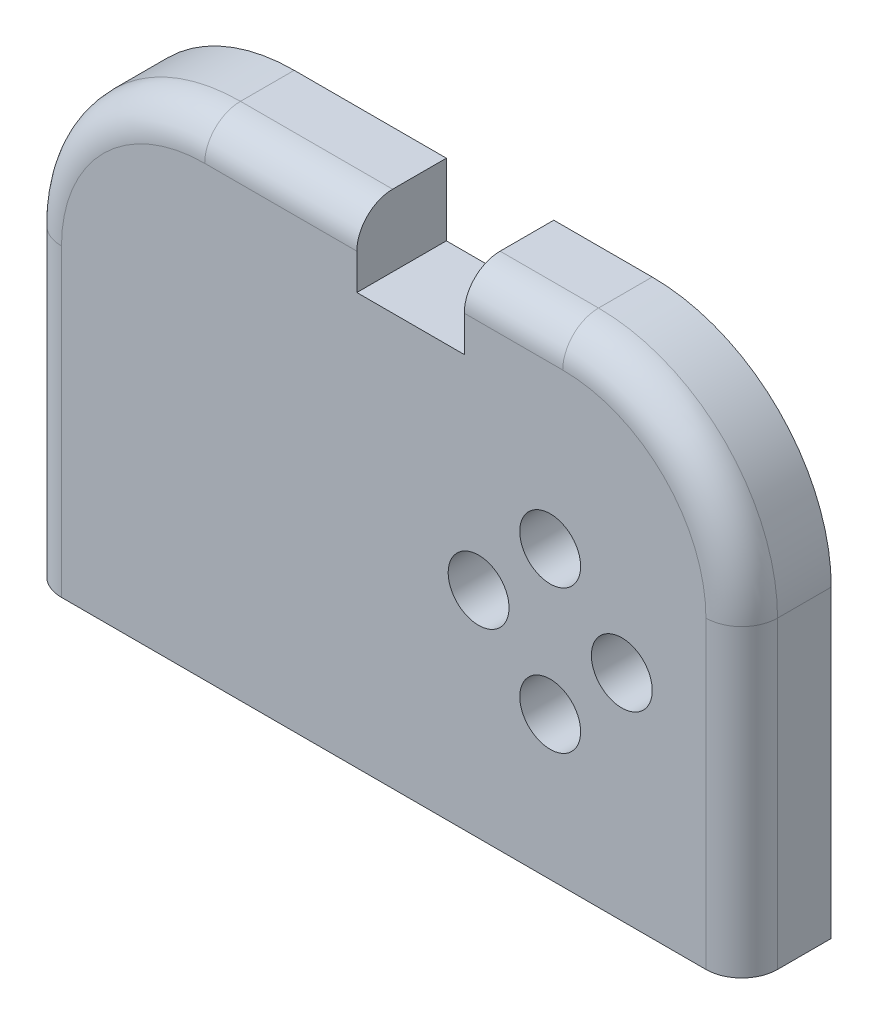
ISO-10303-21;
HEADER;
FILE_DESCRIPTION(('STEP AP214'),'2;1');
FILE_NAME('part.step','',(''),(''),'','','');
FILE_SCHEMA(('AUTOMOTIVE_DESIGN { 1 0 10303 214 1 1 1 1 }'));
ENDSEC;
DATA;
#1=APPLICATION_CONTEXT('core data for automotive mechanical design processes');
#2=APPLICATION_PROTOCOL_DEFINITION('international standard','automotive_design',2000,#1);
#3=PRODUCT_CONTEXT('',#1,'mechanical');
#4=PRODUCT('Part','Part','',(#3));
#5=PRODUCT_RELATED_PRODUCT_CATEGORY('part','',(#4));
#6=PRODUCT_DEFINITION_FORMATION('','',#4);
#7=PRODUCT_DEFINITION_CONTEXT('part definition',#1,'design');
#8=PRODUCT_DEFINITION('design','',#6,#7);
#9=PRODUCT_DEFINITION_SHAPE('','',#8);
#10=(LENGTH_UNIT() NAMED_UNIT(*) SI_UNIT(.MILLI.,.METRE.));
#11=(NAMED_UNIT(*) PLANE_ANGLE_UNIT() SI_UNIT($,.RADIAN.));
#12=(NAMED_UNIT(*) SI_UNIT($,.STERADIAN.) SOLID_ANGLE_UNIT());
#13=UNCERTAINTY_MEASURE_WITH_UNIT(LENGTH_MEASURE(1.E-05),#10,'distance_accuracy_value','');
#14=(GEOMETRIC_REPRESENTATION_CONTEXT(3) GLOBAL_UNCERTAINTY_ASSIGNED_CONTEXT((#13)) GLOBAL_UNIT_ASSIGNED_CONTEXT((#10,
#11,#12)) REPRESENTATION_CONTEXT('',''));
#15=CARTESIAN_POINT('',(0.,0.,0.));
#16=DIRECTION('',(0.,0.,1.));
#17=DIRECTION('',(1.,0.,0.));
#18=AXIS2_PLACEMENT_3D('',#15,#16,#17);
#19=CARTESIAN_POINT('',(20.,13.5,-5.));
#20=DIRECTION('',(-1.,0.,0.));
#21=DIRECTION('',(0.,-1.,0.));
#22=AXIS2_PLACEMENT_3D('',#19,#20,#21);
#23=PLANE('',#22);
#24=DIRECTION('',(0.,0.,1.));
#25=VECTOR('',#24,1.);
#26=CARTESIAN_POINT('',(20.,-13.5,-5.));
#27=LINE('',#26,#25);
#28=CARTESIAN_POINT('',(20.,-13.5,-5.));
#29=VERTEX_POINT('',#28);
#30=CARTESIAN_POINT('',(20.,-13.5,-2.));
#31=VERTEX_POINT('',#30);
#32=EDGE_CURVE('E207',#29,#31,#27,.T.);
#33=ORIENTED_EDGE('',*,*,#32,.F.);
#34=DIRECTION('',(0.,1.,0.));
#35=VECTOR('',#34,1.);
#36=CARTESIAN_POINT('',(20.,13.5,-5.));
#37=LINE('',#36,#35);
#38=CARTESIAN_POINT('',(20.,3.5,-5.));
#39=VERTEX_POINT('',#38);
#40=EDGE_CURVE('E183',#29,#39,#37,.T.);
#41=ORIENTED_EDGE('',*,*,#40,.T.);
#42=DIRECTION('',(0.,0.,1.));
#43=VECTOR('',#42,1.);
#44=CARTESIAN_POINT('',(20.,3.5,-5.));
#45=LINE('',#44,#43);
#46=CARTESIAN_POINT('',(20.,3.5,-2.));
#47=VERTEX_POINT('',#46);
#48=EDGE_CURVE('E250',#47,#39,#45,.F.);
#49=ORIENTED_EDGE('',*,*,#48,.F.);
#50=DIRECTION('',(0.,1.,0.));
#51=VECTOR('',#50,1.);
#52=CARTESIAN_POINT('',(20.,13.5,-2.));
#53=LINE('',#52,#51);
#54=EDGE_CURVE('E11',#31,#47,#53,.T.);
#55=ORIENTED_EDGE('',*,*,#54,.F.);
#56=EDGE_LOOP('',(#33,#41,#49,#55));
#57=FACE_BOUND('',#56,.T.);
#58=ADVANCED_FACE('F41',(#57),#23,.F.);
#59=CARTESIAN_POINT('',(4.49999999999999,13.5,-5.));
#60=DIRECTION('',(0.,-1.,0.));
#61=DIRECTION('',(0.,0.,1.));
#62=AXIS2_PLACEMENT_3D('',#59,#60,#61);
#63=PLANE('',#62);
#64=DIRECTION('',(0.,0.,1.));
#65=VECTOR('',#64,1.);
#66=CARTESIAN_POINT('',(9.99999999999999,13.5,-5.));
#67=LINE('',#66,#65);
#68=CARTESIAN_POINT('',(9.99999999999999,13.5,-5.));
#69=VERTEX_POINT('',#68);
#70=CARTESIAN_POINT('',(9.99999999999999,13.5,-2.));
#71=VERTEX_POINT('',#70);
#72=EDGE_CURVE('E247',#69,#71,#67,.T.);
#73=ORIENTED_EDGE('',*,*,#72,.F.);
#74=DIRECTION('',(-1.,0.,0.));
#75=VECTOR('',#74,1.);
#76=CARTESIAN_POINT('',(4.49999999999999,13.5,-5.));
#77=LINE('',#76,#75);
#78=CARTESIAN_POINT('',(4.49999999999999,13.5,-5.));
#79=VERTEX_POINT('',#78);
#80=EDGE_CURVE('E186',#69,#79,#77,.T.);
#81=ORIENTED_EDGE('',*,*,#80,.T.);
#82=DIRECTION('',(0.,0.,1.));
#83=VECTOR('',#82,1.);
#84=CARTESIAN_POINT('',(4.49999999999999,13.5,-5.));
#85=LINE('',#84,#83);
#86=CARTESIAN_POINT('',(4.49999999999999,13.5,-2.));
#87=VERTEX_POINT('',#86);
#88=EDGE_CURVE('E234',#79,#87,#85,.T.);
#89=ORIENTED_EDGE('',*,*,#88,.T.);
#90=DIRECTION('',(-1.,0.,0.));
#91=VECTOR('',#90,1.);
#92=CARTESIAN_POINT('',(4.49999999999999,13.5,-2.));
#93=LINE('',#92,#91);
#94=EDGE_CURVE('E279',#71,#87,#93,.T.);
#95=ORIENTED_EDGE('',*,*,#94,.F.);
#96=EDGE_LOOP('',(#73,#81,#89,#95));
#97=FACE_BOUND('',#96,.T.);
#98=ADVANCED_FACE('F314',(#97),#63,.F.);
#99=CARTESIAN_POINT('',(4.49999999999999,9.5,-5.));
#100=DIRECTION('',(1.,0.,0.));
#101=DIRECTION('',(0.,0.,1.));
#102=AXIS2_PLACEMENT_3D('',#99,#100,#101);
#103=PLANE('',#102);
#104=ORIENTED_EDGE('',*,*,#88,.F.);
#105=DIRECTION('',(0.,-1.,0.));
#106=VECTOR('',#105,1.);
#107=CARTESIAN_POINT('',(4.49999999999999,9.5,-5.));
#108=LINE('',#107,#106);
#109=CARTESIAN_POINT('',(4.49999999999999,9.5,-5.));
#110=VERTEX_POINT('',#109);
#111=EDGE_CURVE('E190',#79,#110,#108,.T.);
#112=ORIENTED_EDGE('',*,*,#111,.T.);
#113=DIRECTION('',(0.,0.,1.));
#114=VECTOR('',#113,1.);
#115=CARTESIAN_POINT('',(4.49999999999999,9.5,-5.));
#116=LINE('',#115,#114);
#117=CARTESIAN_POINT('',(4.49999999999999,9.5,0.));
#118=VERTEX_POINT('',#117);
#119=EDGE_CURVE('E231',#110,#118,#116,.T.);
#120=ORIENTED_EDGE('',*,*,#119,.T.);
#121=DIRECTION('',(0.,-1.,0.));
#122=VECTOR('',#121,1.);
#123=CARTESIAN_POINT('',(4.49999999999999,9.5,0.));
#124=LINE('',#123,#122);
#125=CARTESIAN_POINT('',(4.49999999999999,11.5,0.));
#126=VERTEX_POINT('',#125);
#127=EDGE_CURVE('E208',#126,#118,#124,.T.);
#128=ORIENTED_EDGE('',*,*,#127,.F.);
#129=CARTESIAN_POINT('',(4.49999999999999,11.5,-2.));
#130=DIRECTION('',(-1.,0.,0.));
#131=DIRECTION('',(0.,0.,1.));
#132=AXIS2_PLACEMENT_3D('',#129,#130,#131);
#133=CIRCLE('',#132,2.);
#134=EDGE_CURVE('E282',#87,#126,#133,.F.);
#135=ORIENTED_EDGE('',*,*,#134,.F.);
#136=EDGE_LOOP('',(#104,#112,#120,#128,#135));
#137=FACE_BOUND('',#136,.T.);
#138=ADVANCED_FACE('F321',(#137),#103,.F.);
#139=CARTESIAN_POINT('',(-1.50000000000001,9.5,-5.));
#140=DIRECTION('',(0.,-1.,0.));
#141=DIRECTION('',(0.,0.,1.));
#142=AXIS2_PLACEMENT_3D('',#139,#140,#141);
#143=PLANE('',#142);
#144=DIRECTION('',(-1.,0.,0.));
#145=VECTOR('',#144,1.);
#146=CARTESIAN_POINT('',(-1.50000000000001,9.5,0.));
#147=LINE('',#146,#145);
#148=CARTESIAN_POINT('',(-1.50000000000001,9.5,0.));
#149=VERTEX_POINT('',#148);
#150=EDGE_CURVE('E211',#118,#149,#147,.T.);
#151=ORIENTED_EDGE('',*,*,#150,.F.);
#152=ORIENTED_EDGE('',*,*,#119,.F.);
#153=DIRECTION('',(-1.,0.,0.));
#154=VECTOR('',#153,1.);
#155=CARTESIAN_POINT('',(-1.50000000000001,9.5,-5.));
#156=LINE('',#155,#154);
#157=CARTESIAN_POINT('',(-1.50000000000001,9.5,-5.));
#158=VERTEX_POINT('',#157);
#159=EDGE_CURVE('E193',#110,#158,#156,.T.);
#160=ORIENTED_EDGE('',*,*,#159,.T.);
#161=DIRECTION('',(0.,0.,1.));
#162=VECTOR('',#161,1.);
#163=CARTESIAN_POINT('',(-1.50000000000001,9.5,-5.));
#164=LINE('',#163,#162);
#165=EDGE_CURVE('E228',#158,#149,#164,.T.);
#166=ORIENTED_EDGE('',*,*,#165,.T.);
#167=EDGE_LOOP('',(#151,#152,#160,#166));
#168=FACE_BOUND('',#167,.T.);
#169=ADVANCED_FACE('F323',(#168),#143,.F.);
#170=CARTESIAN_POINT('',(-1.50000000000001,13.5,-5.));
#171=DIRECTION('',(-1.,0.,0.));
#172=DIRECTION('',(0.,-1.,0.));
#173=AXIS2_PLACEMENT_3D('',#170,#171,#172);
#174=PLANE('',#173);
#175=DIRECTION('',(0.,1.,0.));
#176=VECTOR('',#175,1.);
#177=CARTESIAN_POINT('',(-1.50000000000001,13.5,0.));
#178=LINE('',#177,#176);
#179=CARTESIAN_POINT('',(-1.50000000000001,11.5,0.));
#180=VERTEX_POINT('',#179);
#181=EDGE_CURVE('E215',#149,#180,#178,.T.);
#182=ORIENTED_EDGE('',*,*,#181,.F.);
#183=ORIENTED_EDGE('',*,*,#165,.F.);
#184=DIRECTION('',(0.,1.,0.));
#185=VECTOR('',#184,1.);
#186=CARTESIAN_POINT('',(-1.50000000000001,13.5,-5.));
#187=LINE('',#186,#185);
#188=CARTESIAN_POINT('',(-1.50000000000001,13.5,-5.));
#189=VERTEX_POINT('',#188);
#190=EDGE_CURVE('E196',#158,#189,#187,.T.);
#191=ORIENTED_EDGE('',*,*,#190,.T.);
#192=DIRECTION('',(0.,0.,1.));
#193=VECTOR('',#192,1.);
#194=CARTESIAN_POINT('',(-1.50000000000001,13.5,-5.));
#195=LINE('',#194,#193);
#196=CARTESIAN_POINT('',(-1.50000000000001,13.5,-2.));
#197=VERTEX_POINT('',#196);
#198=EDGE_CURVE('E225',#189,#197,#195,.T.);
#199=ORIENTED_EDGE('',*,*,#198,.T.);
#200=CARTESIAN_POINT('',(-1.5,11.5,-2.));
#201=DIRECTION('',(1.,0.,0.));
#202=DIRECTION('',(0.,-1.,0.));
#203=AXIS2_PLACEMENT_3D('',#200,#201,#202);
#204=CIRCLE('',#203,2.);
#205=EDGE_CURVE('E50',#180,#197,#204,.F.);
#206=ORIENTED_EDGE('',*,*,#205,.F.);
#207=EDGE_LOOP('',(#182,#183,#191,#199,#206));
#208=FACE_BOUND('',#207,.T.);
#209=ADVANCED_FACE('F326',(#208),#174,.F.);
#210=CARTESIAN_POINT('',(-20.,13.5,-5.));
#211=DIRECTION('',(0.,-1.,0.));
#212=DIRECTION('',(0.,0.,1.));
#213=AXIS2_PLACEMENT_3D('',#210,#211,#212);
#214=PLANE('',#213);
#215=ORIENTED_EDGE('',*,*,#198,.F.);
#216=DIRECTION('',(-1.,0.,0.));
#217=VECTOR('',#216,1.);
#218=CARTESIAN_POINT('',(-20.,13.5,-5.));
#219=LINE('',#218,#217);
#220=CARTESIAN_POINT('',(-10.,13.5,-5.));
#221=VERTEX_POINT('',#220);
#222=EDGE_CURVE('E199',#189,#221,#219,.T.);
#223=ORIENTED_EDGE('',*,*,#222,.T.);
#224=DIRECTION('',(0.,0.,1.));
#225=VECTOR('',#224,1.);
#226=CARTESIAN_POINT('',(-10.,13.5,-5.));
#227=LINE('',#226,#225);
#228=CARTESIAN_POINT('',(-10.,13.5,-2.));
#229=VERTEX_POINT('',#228);
#230=EDGE_CURVE('E240',#229,#221,#227,.F.);
#231=ORIENTED_EDGE('',*,*,#230,.F.);
#232=DIRECTION('',(-1.,0.,0.));
#233=VECTOR('',#232,1.);
#234=CARTESIAN_POINT('',(-20.,13.5,-2.));
#235=LINE('',#234,#233);
#236=EDGE_CURVE('E58',#197,#229,#235,.T.);
#237=ORIENTED_EDGE('',*,*,#236,.F.);
#238=EDGE_LOOP('',(#215,#223,#231,#237));
#239=FACE_BOUND('',#238,.T.);
#240=ADVANCED_FACE('F343',(#239),#214,.F.);
#241=CARTESIAN_POINT('',(-20.,13.5,-5.));
#242=DIRECTION('',(1.,0.,0.));
#243=DIRECTION('',(0.,1.,0.));
#244=AXIS2_PLACEMENT_3D('',#241,#242,#243);
#245=PLANE('',#244);
#246=DIRECTION('',(0.,0.,1.));
#247=VECTOR('',#246,1.);
#248=CARTESIAN_POINT('',(-20.,3.5,-5.));
#249=LINE('',#248,#247);
#250=CARTESIAN_POINT('',(-20.,3.5,-5.));
#251=VERTEX_POINT('',#250);
#252=CARTESIAN_POINT('',(-20.,3.5,-2.));
#253=VERTEX_POINT('',#252);
#254=EDGE_CURVE('E237',#251,#253,#249,.T.);
#255=ORIENTED_EDGE('',*,*,#254,.F.);
#256=DIRECTION('',(0.,-1.,0.));
#257=VECTOR('',#256,1.);
#258=CARTESIAN_POINT('',(-20.,13.5,-5.));
#259=LINE('',#258,#257);
#260=CARTESIAN_POINT('',(-20.,-13.5,-5.));
#261=VERTEX_POINT('',#260);
#262=EDGE_CURVE('E202',#251,#261,#259,.T.);
#263=ORIENTED_EDGE('',*,*,#262,.T.);
#264=DIRECTION('',(0.,0.,1.));
#265=VECTOR('',#264,1.);
#266=CARTESIAN_POINT('',(-20.,-13.5,-5.));
#267=LINE('',#266,#265);
#268=CARTESIAN_POINT('',(-20.,-13.5,-2.));
#269=VERTEX_POINT('',#268);
#270=EDGE_CURVE('E222',#261,#269,#267,.T.);
#271=ORIENTED_EDGE('',*,*,#270,.T.);
#272=DIRECTION('',(0.,-1.,0.));
#273=VECTOR('',#272,1.);
#274=CARTESIAN_POINT('',(-20.,13.5,-2.));
#275=LINE('',#274,#273);
#276=EDGE_CURVE('E253',#253,#269,#275,.T.);
#277=ORIENTED_EDGE('',*,*,#276,.F.);
#278=EDGE_LOOP('',(#255,#263,#271,#277));
#279=FACE_BOUND('',#278,.T.);
#280=ADVANCED_FACE('F340',(#279),#245,.F.);
#281=CARTESIAN_POINT('',(-20.,-13.5,-5.));
#282=DIRECTION('',(0.,1.,0.));
#283=DIRECTION('',(0.,0.,-1.));
#284=AXIS2_PLACEMENT_3D('',#281,#282,#283);
#285=PLANE('',#284);
#286=CARTESIAN_POINT('',(-12.5,-13.5,-3.));
#287=DIRECTION('',(0.,1.,0.));
#288=DIRECTION('',(0.,0.,1.));
#289=AXIS2_PLACEMENT_3D('',#286,#287,#288);
#290=CIRCLE('',#289,0.79999999999999);
#291=CARTESIAN_POINT('',(-12.5,-13.5,-2.20000000000001));
#292=VERTEX_POINT('',#291);
#293=EDGE_CURVE('E164',#292,#292,#290,.T.);
#294=ORIENTED_EDGE('',*,*,#293,.T.);
#295=EDGE_LOOP('',(#294));
#296=FACE_BOUND('',#295,.T.);
#297=CARTESIAN_POINT('',(0.,-13.5,-3.));
#298=DIRECTION('',(0.,1.,0.));
#299=DIRECTION('',(0.,0.,1.));
#300=AXIS2_PLACEMENT_3D('',#297,#298,#299);
#301=CIRCLE('',#300,0.79999999999999);
#302=CARTESIAN_POINT('',(0.,-13.5,-2.20000000000001));
#303=VERTEX_POINT('',#302);
#304=EDGE_CURVE('E163',#303,#303,#301,.T.);
#305=ORIENTED_EDGE('',*,*,#304,.T.);
#306=EDGE_LOOP('',(#305));
#307=FACE_BOUND('',#306,.T.);
#308=CARTESIAN_POINT('',(12.5,-13.5,-3.));
#309=DIRECTION('',(0.,1.,0.));
#310=DIRECTION('',(0.,0.,1.));
#311=AXIS2_PLACEMENT_3D('',#308,#309,#310);
#312=CIRCLE('',#311,0.79999999999999);
#313=CARTESIAN_POINT('',(12.5,-13.5,-2.20000000000001));
#314=VERTEX_POINT('',#313);
#315=EDGE_CURVE('E176',#314,#314,#312,.T.);
#316=ORIENTED_EDGE('',*,*,#315,.T.);
#317=EDGE_LOOP('',(#316));
#318=FACE_BOUND('',#317,.T.);
#319=ORIENTED_EDGE('',*,*,#270,.F.);
#320=DIRECTION('',(1.,0.,0.));
#321=VECTOR('',#320,1.);
#322=CARTESIAN_POINT('',(-20.,-13.5,-5.));
#323=LINE('',#322,#321);
#324=EDGE_CURVE('E205',#261,#29,#323,.T.);
#325=ORIENTED_EDGE('',*,*,#324,.T.);
#326=ORIENTED_EDGE('',*,*,#32,.T.);
#327=CARTESIAN_POINT('',(18.,-13.5,-2.));
#328=DIRECTION('',(0.,-1.,0.));
#329=DIRECTION('',(0.,0.,-1.));
#330=AXIS2_PLACEMENT_3D('',#327,#328,#329);
#331=CIRCLE('',#330,2.);
#332=CARTESIAN_POINT('',(18.,-13.5,0.));
#333=VERTEX_POINT('',#332);
#334=EDGE_CURVE('E256',#333,#31,#331,.F.);
#335=ORIENTED_EDGE('',*,*,#334,.F.);
#336=DIRECTION('',(1.,0.,0.));
#337=VECTOR('',#336,1.);
#338=CARTESIAN_POINT('',(-20.,-13.5,0.));
#339=LINE('',#338,#337);
#340=CARTESIAN_POINT('',(-18.,-13.5,0.));
#341=VERTEX_POINT('',#340);
#342=EDGE_CURVE('E187',#341,#333,#339,.T.);
#343=ORIENTED_EDGE('',*,*,#342,.F.);
#344=CARTESIAN_POINT('',(-18.,-13.5,-2.));
#345=DIRECTION('',(0.,-1.,0.));
#346=DIRECTION('',(0.,0.,-1.));
#347=AXIS2_PLACEMENT_3D('',#344,#345,#346);
#348=CIRCLE('',#347,2.);
#349=EDGE_CURVE('E258',#269,#341,#348,.F.);
#350=ORIENTED_EDGE('',*,*,#349,.F.);
#351=EDGE_LOOP('',(#319,#325,#326,#335,#343,#350));
#352=FACE_BOUND('',#351,.T.);
#353=ADVANCED_FACE('F304',(#296,#307,#318,#352),#285,.F.);
#354=CARTESIAN_POINT('',(0.,0.,-5.));
#355=DIRECTION('',(0.,0.,-1.));
#356=DIRECTION('',(1.,0.,0.));
#357=AXIS2_PLACEMENT_3D('',#354,#355,#356);
#358=PLANE('',#357);
#359=CARTESIAN_POINT('',(9.3,2.5,-5.));
#360=DIRECTION('',(0.,0.,1.));
#361=DIRECTION('',(1.,0.,0.));
#362=AXIS2_PLACEMENT_3D('',#359,#360,#361);
#363=CIRCLE('',#362,1.7);
#364=CARTESIAN_POINT('',(11.,2.5,-5.));
#365=VERTEX_POINT('',#364);
#366=EDGE_CURVE('E602',#365,#365,#363,.T.);
#367=ORIENTED_EDGE('',*,*,#366,.T.);
#368=EDGE_LOOP('',(#367));
#369=FACE_BOUND('',#368,.T.);
#370=CARTESIAN_POINT('',(5.3,-1.5,-5.));
#371=DIRECTION('',(0.,0.,1.));
#372=DIRECTION('',(1.,0.,0.));
#373=AXIS2_PLACEMENT_3D('',#370,#371,#372);
#374=CIRCLE('',#373,1.7);
#375=CARTESIAN_POINT('',(7.,-1.5,-5.));
#376=VERTEX_POINT('',#375);
#377=EDGE_CURVE('E612',#376,#376,#374,.T.);
#378=ORIENTED_EDGE('',*,*,#377,.T.);
#379=EDGE_LOOP('',(#378));
#380=FACE_BOUND('',#379,.T.);
#381=CARTESIAN_POINT('',(9.3,-5.5,-5.));
#382=DIRECTION('',(0.,0.,1.));
#383=DIRECTION('',(1.,0.,0.));
#384=AXIS2_PLACEMENT_3D('',#381,#382,#383);
#385=CIRCLE('',#384,1.7);
#386=CARTESIAN_POINT('',(11.,-5.5,-5.));
#387=VERTEX_POINT('',#386);
#388=EDGE_CURVE('E618',#387,#387,#385,.T.);
#389=ORIENTED_EDGE('',*,*,#388,.T.);
#390=EDGE_LOOP('',(#389));
#391=FACE_BOUND('',#390,.T.);
#392=CARTESIAN_POINT('',(13.3,-1.5,-5.));
#393=DIRECTION('',(0.,0.,1.));
#394=DIRECTION('',(1.,0.,0.));
#395=AXIS2_PLACEMENT_3D('',#392,#393,#394);
#396=CIRCLE('',#395,1.7);
#397=CARTESIAN_POINT('',(15.,-1.5,-5.));
#398=VERTEX_POINT('',#397);
#399=EDGE_CURVE('E170',#398,#398,#396,.T.);
#400=ORIENTED_EDGE('',*,*,#399,.T.);
#401=EDGE_LOOP('',(#400));
#402=FACE_BOUND('',#401,.T.);
#403=ORIENTED_EDGE('',*,*,#222,.F.);
#404=ORIENTED_EDGE('',*,*,#190,.F.);
#405=ORIENTED_EDGE('',*,*,#159,.F.);
#406=ORIENTED_EDGE('',*,*,#111,.F.);
#407=ORIENTED_EDGE('',*,*,#80,.F.);
#408=CARTESIAN_POINT('',(9.99999999999999,3.5,-5.));
#409=DIRECTION('',(0.,0.,1.));
#410=DIRECTION('',(1.,0.,0.));
#411=AXIS2_PLACEMENT_3D('',#408,#409,#410);
#412=CIRCLE('',#411,10.);
#413=EDGE_CURVE('E243',#39,#69,#412,.T.);
#414=ORIENTED_EDGE('',*,*,#413,.F.);
#415=ORIENTED_EDGE('',*,*,#40,.F.);
#416=ORIENTED_EDGE('',*,*,#324,.F.);
#417=ORIENTED_EDGE('',*,*,#262,.F.);
#418=CARTESIAN_POINT('',(-10.,3.5,-5.));
#419=DIRECTION('',(0.,0.,1.));
#420=DIRECTION('',(1.,0.,0.));
#421=AXIS2_PLACEMENT_3D('',#418,#419,#420);
#422=CIRCLE('',#421,10.);
#423=EDGE_CURVE('E245',#221,#251,#422,.T.);
#424=ORIENTED_EDGE('',*,*,#423,.F.);
#425=EDGE_LOOP('',(#403,#404,#405,#406,#407,#414,#415,#416,#417,#424));
#426=FACE_BOUND('',#425,.T.);
#427=ADVANCED_FACE('F342',(#369,#380,#391,#402,#426),#358,.T.);
#428=CARTESIAN_POINT('',(0.,0.,0.));
#429=DIRECTION('',(0.,0.,-1.));
#430=DIRECTION('',(1.,0.,0.));
#431=AXIS2_PLACEMENT_3D('',#428,#429,#430);
#432=PLANE('',#431);
#433=CARTESIAN_POINT('',(9.3,2.5,0.));
#434=DIRECTION('',(0.,0.,-1.));
#435=DIRECTION('',(-1.,0.,0.));
#436=AXIS2_PLACEMENT_3D('',#433,#434,#435);
#437=CIRCLE('',#436,1.7);
#438=CARTESIAN_POINT('',(7.6,2.5,0.));
#439=VERTEX_POINT('',#438);
#440=EDGE_CURVE('E605',#439,#439,#437,.T.);
#441=ORIENTED_EDGE('',*,*,#440,.T.);
#442=EDGE_LOOP('',(#441));
#443=FACE_BOUND('',#442,.T.);
#444=CARTESIAN_POINT('',(5.3,-1.5,0.));
#445=DIRECTION('',(0.,0.,-1.));
#446=DIRECTION('',(-1.,0.,0.));
#447=AXIS2_PLACEMENT_3D('',#444,#445,#446);
#448=CIRCLE('',#447,1.7);
#449=CARTESIAN_POINT('',(3.6,-1.5,0.));
#450=VERTEX_POINT('',#449);
#451=EDGE_CURVE('E607',#450,#450,#448,.T.);
#452=ORIENTED_EDGE('',*,*,#451,.T.);
#453=EDGE_LOOP('',(#452));
#454=FACE_BOUND('',#453,.T.);
#455=CARTESIAN_POINT('',(9.3,-5.5,0.));
#456=DIRECTION('',(0.,0.,-1.));
#457=DIRECTION('',(-1.,0.,0.));
#458=AXIS2_PLACEMENT_3D('',#455,#456,#457);
#459=CIRCLE('',#458,1.7);
#460=CARTESIAN_POINT('',(7.6,-5.5,0.));
#461=VERTEX_POINT('',#460);
#462=EDGE_CURVE('E615',#461,#461,#459,.T.);
#463=ORIENTED_EDGE('',*,*,#462,.T.);
#464=EDGE_LOOP('',(#463));
#465=FACE_BOUND('',#464,.T.);
#466=CARTESIAN_POINT('',(13.3,-1.5,0.));
#467=DIRECTION('',(0.,0.,-1.));
#468=DIRECTION('',(-1.,0.,0.));
#469=AXIS2_PLACEMENT_3D('',#466,#467,#468);
#470=CIRCLE('',#469,1.7);
#471=CARTESIAN_POINT('',(11.6,-1.5,0.));
#472=VERTEX_POINT('',#471);
#473=EDGE_CURVE('E621',#472,#472,#470,.T.);
#474=ORIENTED_EDGE('',*,*,#473,.T.);
#475=EDGE_LOOP('',(#474));
#476=FACE_BOUND('',#475,.T.);
#477=ORIENTED_EDGE('',*,*,#342,.T.);
#478=DIRECTION('',(0.,1.,0.));
#479=VECTOR('',#478,1.);
#480=CARTESIAN_POINT('',(18.,0.,0.));
#481=LINE('',#480,#479);
#482=CARTESIAN_POINT('',(18.,3.5,0.));
#483=VERTEX_POINT('',#482);
#484=EDGE_CURVE('E261',#483,#333,#481,.F.);
#485=ORIENTED_EDGE('',*,*,#484,.F.);
#486=CARTESIAN_POINT('',(9.99999999999999,3.5,0.));
#487=DIRECTION('',(0.,0.,1.));
#488=DIRECTION('',(1.,0.,0.));
#489=AXIS2_PLACEMENT_3D('',#486,#487,#488);
#490=CIRCLE('',#489,8.);
#491=CARTESIAN_POINT('',(9.99999999999999,11.5,0.));
#492=VERTEX_POINT('',#491);
#493=EDGE_CURVE('E263',#492,#483,#490,.F.);
#494=ORIENTED_EDGE('',*,*,#493,.F.);
#495=DIRECTION('',(-1.,0.,0.));
#496=VECTOR('',#495,1.);
#497=CARTESIAN_POINT('',(0.,11.5,0.));
#498=LINE('',#497,#496);
#499=EDGE_CURVE('E265',#126,#492,#498,.F.);
#500=ORIENTED_EDGE('',*,*,#499,.F.);
#501=ORIENTED_EDGE('',*,*,#127,.T.);
#502=ORIENTED_EDGE('',*,*,#150,.T.);
#503=ORIENTED_EDGE('',*,*,#181,.T.);
#504=DIRECTION('',(-1.,0.,0.));
#505=VECTOR('',#504,1.);
#506=CARTESIAN_POINT('',(0.,11.5,0.));
#507=LINE('',#506,#505);
#508=CARTESIAN_POINT('',(-10.,11.5,0.));
#509=VERTEX_POINT('',#508);
#510=EDGE_CURVE('E268',#509,#180,#507,.F.);
#511=ORIENTED_EDGE('',*,*,#510,.F.);
#512=CARTESIAN_POINT('',(-10.,3.5,0.));
#513=DIRECTION('',(0.,0.,1.));
#514=DIRECTION('',(1.,0.,0.));
#515=AXIS2_PLACEMENT_3D('',#512,#513,#514);
#516=CIRCLE('',#515,8.);
#517=CARTESIAN_POINT('',(-18.,3.5,0.));
#518=VERTEX_POINT('',#517);
#519=EDGE_CURVE('E270',#518,#509,#516,.F.);
#520=ORIENTED_EDGE('',*,*,#519,.F.);
#521=DIRECTION('',(0.,-1.,0.));
#522=VECTOR('',#521,1.);
#523=CARTESIAN_POINT('',(-18.,0.,0.));
#524=LINE('',#523,#522);
#525=EDGE_CURVE('E273',#341,#518,#524,.F.);
#526=ORIENTED_EDGE('',*,*,#525,.F.);
#527=EDGE_LOOP('',(#477,#485,#494,#500,#501,#502,#503,#511,#520,#526));
#528=FACE_BOUND('',#527,.T.);
#529=ADVANCED_FACE('F298',(#443,#454,#465,#476,#528),#432,.F.);
#530=CARTESIAN_POINT('',(-10.,3.5,-5.));
#531=DIRECTION('',(0.,0.,1.));
#532=DIRECTION('',(-1.,0.,0.));
#533=AXIS2_PLACEMENT_3D('',#530,#531,#532);
#534=CYLINDRICAL_SURFACE('',#533,10.);
#535=ORIENTED_EDGE('',*,*,#230,.T.);
#536=ORIENTED_EDGE('',*,*,#423,.T.);
#537=ORIENTED_EDGE('',*,*,#254,.T.);
#538=CARTESIAN_POINT('',(-10.,3.5,-2.));
#539=DIRECTION('',(0.,0.,1.));
#540=DIRECTION('',(1.,0.,0.));
#541=AXIS2_PLACEMENT_3D('',#538,#539,#540);
#542=CIRCLE('',#541,10.);
#543=EDGE_CURVE('E276',#229,#253,#542,.T.);
#544=ORIENTED_EDGE('',*,*,#543,.F.);
#545=EDGE_LOOP('',(#535,#536,#537,#544));
#546=FACE_BOUND('',#545,.T.);
#547=ADVANCED_FACE('F360',(#546),#534,.T.);
#548=CARTESIAN_POINT('',(9.99999999999999,3.5,-5.));
#549=DIRECTION('',(0.,0.,1.));
#550=DIRECTION('',(-1.,0.,0.));
#551=AXIS2_PLACEMENT_3D('',#548,#549,#550);
#552=CYLINDRICAL_SURFACE('',#551,10.);
#553=ORIENTED_EDGE('',*,*,#48,.T.);
#554=ORIENTED_EDGE('',*,*,#413,.T.);
#555=ORIENTED_EDGE('',*,*,#72,.T.);
#556=CARTESIAN_POINT('',(9.99999999999999,3.5,-2.));
#557=DIRECTION('',(0.,0.,1.));
#558=DIRECTION('',(1.,0.,0.));
#559=AXIS2_PLACEMENT_3D('',#556,#557,#558);
#560=CIRCLE('',#559,10.);
#561=EDGE_CURVE('E285',#47,#71,#560,.T.);
#562=ORIENTED_EDGE('',*,*,#561,.F.);
#563=EDGE_LOOP('',(#553,#554,#555,#562));
#564=FACE_BOUND('',#563,.T.);
#565=ADVANCED_FACE('F309',(#564),#552,.T.);
#566=CARTESIAN_POINT('',(-20.,11.5,-2.));
#567=DIRECTION('',(-1.,0.,0.));
#568=DIRECTION('',(0.,0.,-1.));
#569=AXIS2_PLACEMENT_3D('',#566,#567,#568);
#570=CYLINDRICAL_SURFACE('',#569,2.);
#571=ORIENTED_EDGE('',*,*,#205,.T.);
#572=ORIENTED_EDGE('',*,*,#236,.T.);
#573=CARTESIAN_POINT('',(-10.,11.5,-2.));
#574=DIRECTION('',(1.,0.,0.));
#575=DIRECTION('',(0.,0.,-1.));
#576=AXIS2_PLACEMENT_3D('',#573,#574,#575);
#577=CIRCLE('',#576,2.);
#578=EDGE_CURVE('E212',#229,#509,#577,.T.);
#579=ORIENTED_EDGE('',*,*,#578,.T.);
#580=ORIENTED_EDGE('',*,*,#510,.T.);
#581=EDGE_LOOP('',(#571,#572,#579,#580));
#582=FACE_BOUND('',#581,.T.);
#583=ADVANCED_FACE('F330',(#582),#570,.T.);
#584=CARTESIAN_POINT('',(-10.,3.5,-2.));
#585=DIRECTION('',(0.,0.,-1.));
#586=DIRECTION('',(1.,0.,0.));
#587=AXIS2_PLACEMENT_3D('',#584,#585,#586);
#588=TOROIDAL_SURFACE('',#587,8.,2.);
#589=ORIENTED_EDGE('',*,*,#578,.F.);
#590=ORIENTED_EDGE('',*,*,#543,.T.);
#591=CARTESIAN_POINT('',(-18.,3.5,-2.));
#592=DIRECTION('',(0.,1.,0.));
#593=DIRECTION('',(1.,0.,0.));
#594=AXIS2_PLACEMENT_3D('',#591,#592,#593);
#595=CIRCLE('',#594,2.);
#596=EDGE_CURVE('E289',#253,#518,#595,.T.);
#597=ORIENTED_EDGE('',*,*,#596,.T.);
#598=ORIENTED_EDGE('',*,*,#519,.T.);
#599=EDGE_LOOP('',(#589,#590,#597,#598));
#600=FACE_BOUND('',#599,.T.);
#601=ADVANCED_FACE('F333',(#600),#588,.T.);
#602=CARTESIAN_POINT('',(-18.,13.5,-2.));
#603=DIRECTION('',(0.,-1.,0.));
#604=DIRECTION('',(1.,0.,0.));
#605=AXIS2_PLACEMENT_3D('',#602,#603,#604);
#606=CYLINDRICAL_SURFACE('',#605,2.);
#607=ORIENTED_EDGE('',*,*,#596,.F.);
#608=ORIENTED_EDGE('',*,*,#276,.T.);
#609=ORIENTED_EDGE('',*,*,#349,.T.);
#610=ORIENTED_EDGE('',*,*,#525,.T.);
#611=EDGE_LOOP('',(#607,#608,#609,#610));
#612=FACE_BOUND('',#611,.T.);
#613=ADVANCED_FACE('F336',(#612),#606,.T.);
#614=CARTESIAN_POINT('',(18.,13.5,-2.));
#615=DIRECTION('',(0.,1.,0.));
#616=DIRECTION('',(-1.,0.,0.));
#617=AXIS2_PLACEMENT_3D('',#614,#615,#616);
#618=CYLINDRICAL_SURFACE('',#617,2.);
#619=ORIENTED_EDGE('',*,*,#334,.T.);
#620=ORIENTED_EDGE('',*,*,#54,.T.);
#621=CARTESIAN_POINT('',(18.,3.5,-2.));
#622=DIRECTION('',(0.,-1.,0.));
#623=DIRECTION('',(-1.,0.,0.));
#624=AXIS2_PLACEMENT_3D('',#621,#622,#623);
#625=CIRCLE('',#624,2.);
#626=EDGE_CURVE('E45',#47,#483,#625,.T.);
#627=ORIENTED_EDGE('',*,*,#626,.T.);
#628=ORIENTED_EDGE('',*,*,#484,.T.);
#629=EDGE_LOOP('',(#619,#620,#627,#628));
#630=FACE_BOUND('',#629,.T.);
#631=ADVANCED_FACE('F43',(#630),#618,.T.);
#632=CARTESIAN_POINT('',(9.99999999999999,3.5,-2.));
#633=DIRECTION('',(0.,0.,-1.));
#634=DIRECTION('',(1.,0.,0.));
#635=AXIS2_PLACEMENT_3D('',#632,#633,#634);
#636=TOROIDAL_SURFACE('',#635,8.,2.);
#637=ORIENTED_EDGE('',*,*,#626,.F.);
#638=ORIENTED_EDGE('',*,*,#561,.T.);
#639=CARTESIAN_POINT('',(9.99999999999999,11.5,-2.));
#640=DIRECTION('',(1.,0.,0.));
#641=DIRECTION('',(0.,0.,-1.));
#642=AXIS2_PLACEMENT_3D('',#639,#640,#641);
#643=CIRCLE('',#642,2.);
#644=EDGE_CURVE('E182',#71,#492,#643,.T.);
#645=ORIENTED_EDGE('',*,*,#644,.T.);
#646=ORIENTED_EDGE('',*,*,#493,.T.);
#647=EDGE_LOOP('',(#637,#638,#645,#646));
#648=FACE_BOUND('',#647,.T.);
#649=ADVANCED_FACE('F296',(#648),#636,.T.);
#650=CARTESIAN_POINT('',(4.49999999999999,11.5,-2.));
#651=DIRECTION('',(-1.,0.,0.));
#652=DIRECTION('',(0.,0.,-1.));
#653=AXIS2_PLACEMENT_3D('',#650,#651,#652);
#654=CYLINDRICAL_SURFACE('',#653,2.);
#655=ORIENTED_EDGE('',*,*,#644,.F.);
#656=ORIENTED_EDGE('',*,*,#94,.T.);
#657=ORIENTED_EDGE('',*,*,#134,.T.);
#658=ORIENTED_EDGE('',*,*,#499,.T.);
#659=EDGE_LOOP('',(#655,#656,#657,#658));
#660=FACE_BOUND('',#659,.T.);
#661=ADVANCED_FACE('F317',(#660),#654,.T.);
#662=CARTESIAN_POINT('',(12.5,-9.5,-3.));
#663=DIRECTION('',(0.,-1.,0.));
#664=DIRECTION('',(0.,0.,1.));
#665=AXIS2_PLACEMENT_3D('',#662,#663,#664);
#666=CONICAL_SURFACE('',#665,0.799999999999999,1.02974425867665);
#667=CARTESIAN_POINT('',(12.5,-9.01931150477795,-3.));
#668=VERTEX_POINT('',#667);
#669=VERTEX_LOOP('',#668);
#670=FACE_BOUND('',#669,.T.);
#671=CARTESIAN_POINT('',(12.5,-9.5,-3.));
#672=DIRECTION('',(0.,1.,0.));
#673=DIRECTION('',(0.,0.,1.));
#674=AXIS2_PLACEMENT_3D('',#671,#672,#673);
#675=CIRCLE('',#674,0.799999999999999);
#676=CARTESIAN_POINT('',(12.5,-9.5,-2.2));
#677=VERTEX_POINT('',#676);
#678=EDGE_CURVE('E179',#677,#677,#675,.T.);
#679=ORIENTED_EDGE('',*,*,#678,.F.);
#680=EDGE_LOOP('',(#679));
#681=FACE_BOUND('',#680,.T.);
#682=ADVANCED_FACE('F373',(#670,#681),#666,.F.);
#683=CARTESIAN_POINT('',(12.5,-13.5,-3.));
#684=DIRECTION('',(0.,-1.,0.));
#685=DIRECTION('',(0.,0.,1.));
#686=AXIS2_PLACEMENT_3D('',#683,#684,#685);
#687=CYLINDRICAL_SURFACE('',#686,0.799999999999994);
#688=ORIENTED_EDGE('',*,*,#678,.T.);
#689=EDGE_LOOP('',(#688));
#690=FACE_BOUND('',#689,.T.);
#691=ORIENTED_EDGE('',*,*,#315,.F.);
#692=EDGE_LOOP('',(#691));
#693=FACE_BOUND('',#692,.T.);
#694=ADVANCED_FACE('F501',(#690,#693),#687,.F.);
#695=CARTESIAN_POINT('',(0.,-9.5,-3.));
#696=DIRECTION('',(0.,-1.,0.));
#697=DIRECTION('',(0.,0.,1.));
#698=AXIS2_PLACEMENT_3D('',#695,#696,#697);
#699=CONICAL_SURFACE('',#698,0.799999999999999,1.02974425867665);
#700=CARTESIAN_POINT('',(0.,-9.01931150477795,-3.));
#701=VERTEX_POINT('',#700);
#702=VERTEX_LOOP('',#701);
#703=FACE_BOUND('',#702,.T.);
#704=CARTESIAN_POINT('',(0.,-9.5,-3.));
#705=DIRECTION('',(0.,1.,0.));
#706=DIRECTION('',(0.,0.,1.));
#707=AXIS2_PLACEMENT_3D('',#704,#705,#706);
#708=CIRCLE('',#707,0.799999999999999);
#709=CARTESIAN_POINT('',(0.,-9.5,-2.2));
#710=VERTEX_POINT('',#709);
#711=EDGE_CURVE('E167',#710,#710,#708,.T.);
#712=ORIENTED_EDGE('',*,*,#711,.F.);
#713=EDGE_LOOP('',(#712));
#714=FACE_BOUND('',#713,.T.);
#715=ADVANCED_FACE('F510',(#703,#714),#699,.F.);
#716=CARTESIAN_POINT('',(0.,-13.5,-3.));
#717=DIRECTION('',(0.,-1.,0.));
#718=DIRECTION('',(0.,0.,1.));
#719=AXIS2_PLACEMENT_3D('',#716,#717,#718);
#720=CYLINDRICAL_SURFACE('',#719,0.799999999999994);
#721=ORIENTED_EDGE('',*,*,#711,.T.);
#722=EDGE_LOOP('',(#721));
#723=FACE_BOUND('',#722,.T.);
#724=ORIENTED_EDGE('',*,*,#304,.F.);
#725=EDGE_LOOP('',(#724));
#726=FACE_BOUND('',#725,.T.);
#727=ADVANCED_FACE('F157',(#723,#726),#720,.F.);
#728=CARTESIAN_POINT('',(-12.5,-9.5,-3.));
#729=DIRECTION('',(0.,-1.,0.));
#730=DIRECTION('',(0.,0.,1.));
#731=AXIS2_PLACEMENT_3D('',#728,#729,#730);
#732=CONICAL_SURFACE('',#731,0.799999999999999,1.02974425867665);
#733=CARTESIAN_POINT('',(-12.5,-9.01931150477795,-3.));
#734=VERTEX_POINT('',#733);
#735=VERTEX_LOOP('',#734);
#736=FACE_BOUND('',#735,.T.);
#737=CARTESIAN_POINT('',(-12.5,-9.5,-3.));
#738=DIRECTION('',(0.,1.,0.));
#739=DIRECTION('',(0.,0.,1.));
#740=AXIS2_PLACEMENT_3D('',#737,#738,#739);
#741=CIRCLE('',#740,0.799999999999999);
#742=CARTESIAN_POINT('',(-12.5,-9.5,-2.2));
#743=VERTEX_POINT('',#742);
#744=EDGE_CURVE('E161',#743,#743,#741,.T.);
#745=ORIENTED_EDGE('',*,*,#744,.F.);
#746=EDGE_LOOP('',(#745));
#747=FACE_BOUND('',#746,.T.);
#748=ADVANCED_FACE('F153',(#736,#747),#732,.F.);
#749=CARTESIAN_POINT('',(-12.5,-13.5,-3.));
#750=DIRECTION('',(0.,-1.,0.));
#751=DIRECTION('',(0.,0.,1.));
#752=AXIS2_PLACEMENT_3D('',#749,#750,#751);
#753=CYLINDRICAL_SURFACE('',#752,0.799999999999994);
#754=ORIENTED_EDGE('',*,*,#744,.T.);
#755=EDGE_LOOP('',(#754));
#756=FACE_BOUND('',#755,.T.);
#757=ORIENTED_EDGE('',*,*,#293,.F.);
#758=EDGE_LOOP('',(#757));
#759=FACE_BOUND('',#758,.T.);
#760=ADVANCED_FACE('F156',(#756,#759),#753,.F.);
#761=CARTESIAN_POINT('',(13.3,-1.5,0.));
#762=DIRECTION('',(0.,0.,1.));
#763=DIRECTION('',(-1.,0.,0.));
#764=AXIS2_PLACEMENT_3D('',#761,#762,#763);
#765=CYLINDRICAL_SURFACE('',#764,1.7);
#766=ORIENTED_EDGE('',*,*,#399,.F.);
#767=EDGE_LOOP('',(#766));
#768=FACE_BOUND('',#767,.T.);
#769=ORIENTED_EDGE('',*,*,#473,.F.);
#770=EDGE_LOOP('',(#769));
#771=FACE_BOUND('',#770,.T.);
#772=ADVANCED_FACE('F546',(#768,#771),#765,.F.);
#773=CARTESIAN_POINT('',(9.3,-5.5,0.));
#774=DIRECTION('',(0.,0.,1.));
#775=DIRECTION('',(-1.,0.,0.));
#776=AXIS2_PLACEMENT_3D('',#773,#774,#775);
#777=CYLINDRICAL_SURFACE('',#776,1.7);
#778=ORIENTED_EDGE('',*,*,#388,.F.);
#779=EDGE_LOOP('',(#778));
#780=FACE_BOUND('',#779,.T.);
#781=ORIENTED_EDGE('',*,*,#462,.F.);
#782=EDGE_LOOP('',(#781));
#783=FACE_BOUND('',#782,.T.);
#784=ADVANCED_FACE('F556',(#780,#783),#777,.F.);
#785=CARTESIAN_POINT('',(5.3,-1.5,0.));
#786=DIRECTION('',(0.,0.,1.));
#787=DIRECTION('',(-1.,0.,0.));
#788=AXIS2_PLACEMENT_3D('',#785,#786,#787);
#789=CYLINDRICAL_SURFACE('',#788,1.7);
#790=ORIENTED_EDGE('',*,*,#377,.F.);
#791=EDGE_LOOP('',(#790));
#792=FACE_BOUND('',#791,.T.);
#793=ORIENTED_EDGE('',*,*,#451,.F.);
#794=EDGE_LOOP('',(#793));
#795=FACE_BOUND('',#794,.T.);
#796=ADVANCED_FACE('F565',(#792,#795),#789,.F.);
#797=CARTESIAN_POINT('',(9.3,2.5,0.));
#798=DIRECTION('',(0.,0.,1.));
#799=DIRECTION('',(-1.,0.,0.));
#800=AXIS2_PLACEMENT_3D('',#797,#798,#799);
#801=CYLINDRICAL_SURFACE('',#800,1.7);
#802=ORIENTED_EDGE('',*,*,#366,.F.);
#803=EDGE_LOOP('',(#802));
#804=FACE_BOUND('',#803,.T.);
#805=ORIENTED_EDGE('',*,*,#440,.F.);
#806=EDGE_LOOP('',(#805));
#807=FACE_BOUND('',#806,.T.);
#808=ADVANCED_FACE('F574',(#804,#807),#801,.F.);
#809=CLOSED_SHELL('',(#58,#98,#138,#169,#209,#240,#280,#353,#427,#529,#547,#565,#583,#601,#613,
#631,#649,#661,#682,#694,#715,#727,#748,#760,#772,#784,#796,#808));
#810=MANIFOLD_SOLID_BREP('B2',#809);
#811=ADVANCED_BREP_SHAPE_REPRESENTATION('',(#18,#810),#14);
#812=SHAPE_DEFINITION_REPRESENTATION(#9,#811);
ENDSEC;
END-ISO-10303-21;
